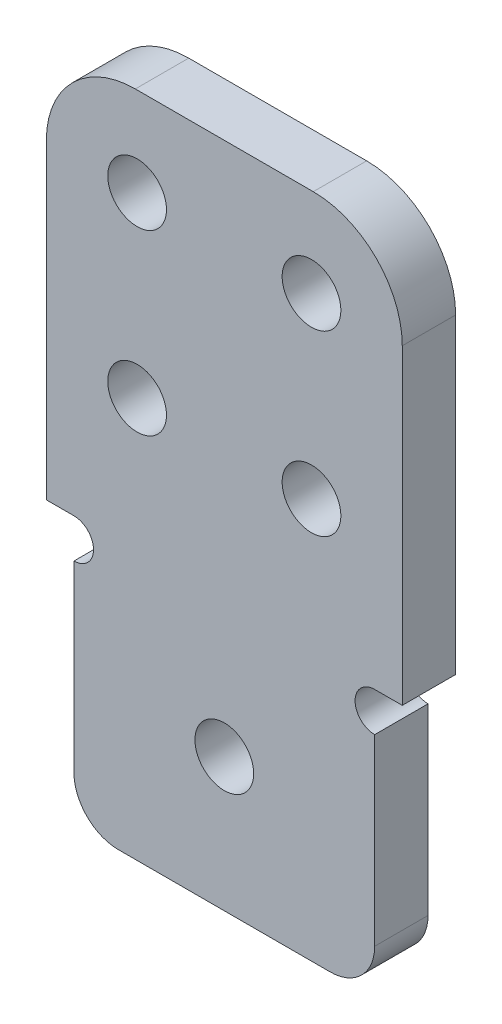
ISO-10303-21;
HEADER;
FILE_DESCRIPTION(('STEP AP214'),'2;1');
FILE_NAME('part.step','',(''),(''),'','','');
FILE_SCHEMA(('AUTOMOTIVE_DESIGN { 1 0 10303 214 1 1 1 1 }'));
ENDSEC;
DATA;
#1=APPLICATION_CONTEXT('core data for automotive mechanical design processes');
#2=APPLICATION_PROTOCOL_DEFINITION('international standard','automotive_design',2000,#1);
#3=PRODUCT_CONTEXT('',#1,'mechanical');
#4=PRODUCT('Part','Part','',(#3));
#5=PRODUCT_RELATED_PRODUCT_CATEGORY('part','',(#4));
#6=PRODUCT_DEFINITION_FORMATION('','',#4);
#7=PRODUCT_DEFINITION_CONTEXT('part definition',#1,'design');
#8=PRODUCT_DEFINITION('design','',#6,#7);
#9=PRODUCT_DEFINITION_SHAPE('','',#8);
#10=(LENGTH_UNIT() NAMED_UNIT(*) SI_UNIT(.MILLI.,.METRE.));
#11=(NAMED_UNIT(*) PLANE_ANGLE_UNIT() SI_UNIT($,.RADIAN.));
#12=(NAMED_UNIT(*) SI_UNIT($,.STERADIAN.) SOLID_ANGLE_UNIT());
#13=UNCERTAINTY_MEASURE_WITH_UNIT(LENGTH_MEASURE(1.E-05),#10,'distance_accuracy_value','');
#14=(GEOMETRIC_REPRESENTATION_CONTEXT(3) GLOBAL_UNCERTAINTY_ASSIGNED_CONTEXT((#13)) GLOBAL_UNIT_ASSIGNED_CONTEXT((#10,
#11,#12)) REPRESENTATION_CONTEXT('',''));
#15=CARTESIAN_POINT('',(0.,0.,0.));
#16=DIRECTION('',(0.,0.,1.));
#17=DIRECTION('',(1.,0.,0.));
#18=AXIS2_PLACEMENT_3D('',#15,#16,#17);
#19=CARTESIAN_POINT('',(-8.45,-13.6,3.));
#20=DIRECTION('',(0.,0.,1.));
#21=DIRECTION('',(1.,0.,0.));
#22=AXIS2_PLACEMENT_3D('',#19,#20,#21);
#23=PLANE('',#22);
#24=CARTESIAN_POINT('',(4.9,5.,3.));
#25=DIRECTION('',(0.,0.,1.));
#26=DIRECTION('',(1.,0.,0.));
#27=AXIS2_PLACEMENT_3D('',#24,#25,#26);
#28=CIRCLE('',#27,1.65);
#29=CARTESIAN_POINT('',(6.55,5.,3.));
#30=VERTEX_POINT('',#29);
#31=EDGE_CURVE('E298',#30,#30,#28,.T.);
#32=ORIENTED_EDGE('',*,*,#31,.F.);
#33=EDGE_LOOP('',(#32));
#34=FACE_BOUND('',#33,.T.);
#35=CARTESIAN_POINT('',(-4.9,-5.,3.));
#36=DIRECTION('',(0.,0.,1.));
#37=DIRECTION('',(1.,0.,0.));
#38=AXIS2_PLACEMENT_3D('',#35,#36,#37);
#39=CIRCLE('',#38,1.65);
#40=CARTESIAN_POINT('',(-3.25,-5.,3.));
#41=VERTEX_POINT('',#40);
#42=EDGE_CURVE('E286',#41,#41,#39,.T.);
#43=ORIENTED_EDGE('',*,*,#42,.F.);
#44=EDGE_LOOP('',(#43));
#45=FACE_BOUND('',#44,.T.);
#46=DIRECTION('',(-1.,0.,0.));
#47=VECTOR('',#46,1.);
#48=CARTESIAN_POINT('',(-10.,9.99999999999999,3.));
#49=LINE('',#48,#47);
#50=CARTESIAN_POINT('',(5.,10.,3.));
#51=VERTEX_POINT('',#50);
#52=CARTESIAN_POINT('',(-5.,9.99999999999999,3.));
#53=VERTEX_POINT('',#52);
#54=EDGE_CURVE('E153',#51,#53,#49,.T.);
#55=ORIENTED_EDGE('',*,*,#54,.T.);
#56=CARTESIAN_POINT('',(-5.,4.99999999999999,3.));
#57=DIRECTION('',(0.,0.,1.));
#58=DIRECTION('',(1.,0.,0.));
#59=AXIS2_PLACEMENT_3D('',#56,#57,#58);
#60=CIRCLE('',#59,5.);
#61=CARTESIAN_POINT('',(-10.,4.99999999999999,3.));
#62=VERTEX_POINT('',#61);
#63=EDGE_CURVE('E149',#53,#62,#60,.T.);
#64=ORIENTED_EDGE('',*,*,#63,.T.);
#65=DIRECTION('',(0.,-1.,0.));
#66=VECTOR('',#65,1.);
#67=CARTESIAN_POINT('',(-10.,-12.5,3.));
#68=LINE('',#67,#66);
#69=CARTESIAN_POINT('',(-10.,-12.5,3.));
#70=VERTEX_POINT('',#69);
#71=EDGE_CURVE('E141',#62,#70,#68,.T.);
#72=ORIENTED_EDGE('',*,*,#71,.T.);
#73=DIRECTION('',(1.,0.,0.));
#74=VECTOR('',#73,1.);
#75=CARTESIAN_POINT('',(-10.,-12.5,3.));
#76=LINE('',#75,#74);
#77=CARTESIAN_POINT('',(-8.45,-12.5,3.));
#78=VERTEX_POINT('',#77);
#79=EDGE_CURVE('E146',#70,#78,#76,.T.);
#80=ORIENTED_EDGE('',*,*,#79,.T.);
#81=CARTESIAN_POINT('',(-8.45,-13.6,3.));
#82=DIRECTION('',(0.,0.,-1.));
#83=DIRECTION('',(1.,0.,0.));
#84=AXIS2_PLACEMENT_3D('',#81,#82,#83);
#85=CIRCLE('',#84,1.1);
#86=CARTESIAN_POINT('',(-8.45,-14.7,3.));
#87=VERTEX_POINT('',#86);
#88=EDGE_CURVE('E168',#78,#87,#85,.T.);
#89=ORIENTED_EDGE('',*,*,#88,.T.);
#90=DIRECTION('',(0.,-1.,0.));
#91=VECTOR('',#90,1.);
#92=CARTESIAN_POINT('',(-8.45,-14.7,3.));
#93=LINE('',#92,#91);
#94=CARTESIAN_POINT('',(-8.45,-25.,3.));
#95=VERTEX_POINT('',#94);
#96=EDGE_CURVE('E170',#87,#95,#93,.T.);
#97=ORIENTED_EDGE('',*,*,#96,.T.);
#98=CARTESIAN_POINT('',(-5.94999999999999,-25.,3.));
#99=DIRECTION('',(0.,0.,1.));
#100=DIRECTION('',(1.,0.,0.));
#101=AXIS2_PLACEMENT_3D('',#98,#99,#100);
#102=CIRCLE('',#101,2.5);
#103=CARTESIAN_POINT('',(-5.95,-27.5,3.));
#104=VERTEX_POINT('',#103);
#105=EDGE_CURVE('E235',#95,#104,#102,.T.);
#106=ORIENTED_EDGE('',*,*,#105,.T.);
#107=DIRECTION('',(1.,0.,0.));
#108=VECTOR('',#107,1.);
#109=CARTESIAN_POINT('',(-8.45,-27.5,3.));
#110=LINE('',#109,#108);
#111=CARTESIAN_POINT('',(5.95,-27.5,3.));
#112=VERTEX_POINT('',#111);
#113=EDGE_CURVE('E176',#104,#112,#110,.T.);
#114=ORIENTED_EDGE('',*,*,#113,.T.);
#115=CARTESIAN_POINT('',(5.95,-25.,3.));
#116=DIRECTION('',(0.,0.,1.));
#117=DIRECTION('',(1.,0.,0.));
#118=AXIS2_PLACEMENT_3D('',#115,#116,#117);
#119=CIRCLE('',#118,2.5);
#120=CARTESIAN_POINT('',(8.45,-25.,3.));
#121=VERTEX_POINT('',#120);
#122=EDGE_CURVE('E57',#112,#121,#119,.T.);
#123=ORIENTED_EDGE('',*,*,#122,.T.);
#124=DIRECTION('',(0.,1.,0.));
#125=VECTOR('',#124,1.);
#126=CARTESIAN_POINT('',(8.45,-14.7,3.));
#127=LINE('',#126,#125);
#128=CARTESIAN_POINT('',(8.45,-14.7,3.));
#129=VERTEX_POINT('',#128);
#130=EDGE_CURVE('E178',#121,#129,#127,.T.);
#131=ORIENTED_EDGE('',*,*,#130,.T.);
#132=CARTESIAN_POINT('',(8.45,-13.6,3.));
#133=DIRECTION('',(0.,0.,-1.));
#134=DIRECTION('',(1.,0.,0.));
#135=AXIS2_PLACEMENT_3D('',#132,#133,#134);
#136=CIRCLE('',#135,1.1);
#137=CARTESIAN_POINT('',(8.45,-12.5,3.));
#138=VERTEX_POINT('',#137);
#139=EDGE_CURVE('E180',#129,#138,#136,.T.);
#140=ORIENTED_EDGE('',*,*,#139,.T.);
#141=DIRECTION('',(1.,0.,0.));
#142=VECTOR('',#141,1.);
#143=CARTESIAN_POINT('',(10.,-12.5,3.));
#144=LINE('',#143,#142);
#145=CARTESIAN_POINT('',(10.,-12.5,3.));
#146=VERTEX_POINT('',#145);
#147=EDGE_CURVE('E182',#138,#146,#144,.T.);
#148=ORIENTED_EDGE('',*,*,#147,.T.);
#149=DIRECTION('',(0.,1.,0.));
#150=VECTOR('',#149,1.);
#151=CARTESIAN_POINT('',(10.,-12.5,3.));
#152=LINE('',#151,#150);
#153=CARTESIAN_POINT('',(10.,4.99999999999999,3.));
#154=VERTEX_POINT('',#153);
#155=EDGE_CURVE('E208',#146,#154,#152,.T.);
#156=ORIENTED_EDGE('',*,*,#155,.T.);
#157=CARTESIAN_POINT('',(5.,5.,3.));
#158=DIRECTION('',(0.,0.,1.));
#159=DIRECTION('',(1.,0.,0.));
#160=AXIS2_PLACEMENT_3D('',#157,#158,#159);
#161=CIRCLE('',#160,5.);
#162=EDGE_CURVE('E238',#154,#51,#161,.T.);
#163=ORIENTED_EDGE('',*,*,#162,.T.);
#164=EDGE_LOOP('',(#55,#64,#72,#80,#89,#97,#106,#114,#123,#131,#140,#148,#156,#163));
#165=FACE_BOUND('',#164,.T.);
#166=CARTESIAN_POINT('',(-4.9,5.,3.));
#167=DIRECTION('',(0.,0.,1.));
#168=DIRECTION('',(1.,0.,0.));
#169=AXIS2_PLACEMENT_3D('',#166,#167,#168);
#170=CIRCLE('',#169,1.65);
#171=CARTESIAN_POINT('',(-3.25,5.,3.));
#172=VERTEX_POINT('',#171);
#173=EDGE_CURVE('E189',#172,#172,#170,.T.);
#174=ORIENTED_EDGE('',*,*,#173,.F.);
#175=EDGE_LOOP('',(#174));
#176=FACE_BOUND('',#175,.T.);
#177=CARTESIAN_POINT('',(4.9,-5.,3.));
#178=DIRECTION('',(0.,0.,1.));
#179=DIRECTION('',(1.,0.,0.));
#180=AXIS2_PLACEMENT_3D('',#177,#178,#179);
#181=CIRCLE('',#180,1.65);
#182=CARTESIAN_POINT('',(6.55,-5.,3.));
#183=VERTEX_POINT('',#182);
#184=EDGE_CURVE('E292',#183,#183,#181,.T.);
#185=ORIENTED_EDGE('',*,*,#184,.F.);
#186=EDGE_LOOP('',(#185));
#187=FACE_BOUND('',#186,.T.);
#188=CARTESIAN_POINT('',(0.,-20.,3.));
#189=DIRECTION('',(0.,0.,1.));
#190=DIRECTION('',(1.,0.,0.));
#191=AXIS2_PLACEMENT_3D('',#188,#189,#190);
#192=CIRCLE('',#191,1.65);
#193=CARTESIAN_POINT('',(1.65,-20.,3.));
#194=VERTEX_POINT('',#193);
#195=EDGE_CURVE('E304',#194,#194,#192,.T.);
#196=ORIENTED_EDGE('',*,*,#195,.F.);
#197=EDGE_LOOP('',(#196));
#198=FACE_BOUND('',#197,.T.);
#199=ADVANCED_FACE('F42',(#34,#45,#165,#176,#187,#198),#23,.T.);
#200=CARTESIAN_POINT('',(-8.45,-13.6,0.));
#201=DIRECTION('',(0.,0.,1.));
#202=DIRECTION('',(1.,0.,0.));
#203=AXIS2_PLACEMENT_3D('',#200,#201,#202);
#204=PLANE('',#203);
#205=DIRECTION('',(0.,-1.,0.));
#206=VECTOR('',#205,1.);
#207=CARTESIAN_POINT('',(-10.,-12.5,0.));
#208=LINE('',#207,#206);
#209=CARTESIAN_POINT('',(-10.,4.99999999999999,0.));
#210=VERTEX_POINT('',#209);
#211=CARTESIAN_POINT('',(-10.,-12.5,0.));
#212=VERTEX_POINT('',#211);
#213=EDGE_CURVE('E159',#210,#212,#208,.T.);
#214=ORIENTED_EDGE('',*,*,#213,.F.);
#215=CARTESIAN_POINT('',(-5.,4.99999999999999,0.));
#216=DIRECTION('',(0.,0.,1.));
#217=DIRECTION('',(1.,0.,0.));
#218=AXIS2_PLACEMENT_3D('',#215,#216,#217);
#219=CIRCLE('',#218,5.);
#220=CARTESIAN_POINT('',(-5.,9.99999999999999,0.));
#221=VERTEX_POINT('',#220);
#222=EDGE_CURVE('E228',#210,#221,#219,.F.);
#223=ORIENTED_EDGE('',*,*,#222,.T.);
#224=DIRECTION('',(-1.,0.,0.));
#225=VECTOR('',#224,1.);
#226=CARTESIAN_POINT('',(-10.,9.99999999999999,0.));
#227=LINE('',#226,#225);
#228=CARTESIAN_POINT('',(5.,10.,0.));
#229=VERTEX_POINT('',#228);
#230=EDGE_CURVE('E188',#229,#221,#227,.T.);
#231=ORIENTED_EDGE('',*,*,#230,.F.);
#232=CARTESIAN_POINT('',(5.,5.,0.));
#233=DIRECTION('',(0.,0.,1.));
#234=DIRECTION('',(1.,0.,0.));
#235=AXIS2_PLACEMENT_3D('',#232,#233,#234);
#236=CIRCLE('',#235,5.);
#237=CARTESIAN_POINT('',(10.,4.99999999999999,0.));
#238=VERTEX_POINT('',#237);
#239=EDGE_CURVE('E226',#229,#238,#236,.F.);
#240=ORIENTED_EDGE('',*,*,#239,.T.);
#241=DIRECTION('',(0.,1.,0.));
#242=VECTOR('',#241,1.);
#243=CARTESIAN_POINT('',(10.,-12.5,0.));
#244=LINE('',#243,#242);
#245=CARTESIAN_POINT('',(10.,-12.5,0.));
#246=VERTEX_POINT('',#245);
#247=EDGE_CURVE('E185',#246,#238,#244,.T.);
#248=ORIENTED_EDGE('',*,*,#247,.F.);
#249=DIRECTION('',(1.,0.,0.));
#250=VECTOR('',#249,1.);
#251=CARTESIAN_POINT('',(10.,-12.5,0.));
#252=LINE('',#251,#250);
#253=CARTESIAN_POINT('',(8.45,-12.5,0.));
#254=VERTEX_POINT('',#253);
#255=EDGE_CURVE('E206',#254,#246,#252,.T.);
#256=ORIENTED_EDGE('',*,*,#255,.F.);
#257=CARTESIAN_POINT('',(8.45,-13.6,0.));
#258=DIRECTION('',(0.,0.,-1.));
#259=DIRECTION('',(1.,0.,0.));
#260=AXIS2_PLACEMENT_3D('',#257,#258,#259);
#261=CIRCLE('',#260,1.1);
#262=CARTESIAN_POINT('',(8.45,-14.7,0.));
#263=VERTEX_POINT('',#262);
#264=EDGE_CURVE('E204',#263,#254,#261,.T.);
#265=ORIENTED_EDGE('',*,*,#264,.F.);
#266=DIRECTION('',(0.,1.,0.));
#267=VECTOR('',#266,1.);
#268=CARTESIAN_POINT('',(8.45,-14.7,0.));
#269=LINE('',#268,#267);
#270=CARTESIAN_POINT('',(8.45,-25.,0.));
#271=VERTEX_POINT('',#270);
#272=EDGE_CURVE('E202',#271,#263,#269,.T.);
#273=ORIENTED_EDGE('',*,*,#272,.F.);
#274=CARTESIAN_POINT('',(5.95,-25.,0.));
#275=DIRECTION('',(0.,0.,1.));
#276=DIRECTION('',(1.,0.,0.));
#277=AXIS2_PLACEMENT_3D('',#274,#275,#276);
#278=CIRCLE('',#277,2.5);
#279=CARTESIAN_POINT('',(5.95,-27.5,0.));
#280=VERTEX_POINT('',#279);
#281=EDGE_CURVE('E224',#271,#280,#278,.F.);
#282=ORIENTED_EDGE('',*,*,#281,.T.);
#283=DIRECTION('',(1.,0.,0.));
#284=VECTOR('',#283,1.);
#285=CARTESIAN_POINT('',(-8.45,-27.5,0.));
#286=LINE('',#285,#284);
#287=CARTESIAN_POINT('',(-5.95,-27.5,0.));
#288=VERTEX_POINT('',#287);
#289=EDGE_CURVE('E200',#288,#280,#286,.T.);
#290=ORIENTED_EDGE('',*,*,#289,.F.);
#291=CARTESIAN_POINT('',(-5.94999999999999,-25.,0.));
#292=DIRECTION('',(0.,0.,1.));
#293=DIRECTION('',(1.,0.,0.));
#294=AXIS2_PLACEMENT_3D('',#291,#292,#293);
#295=CIRCLE('',#294,2.5);
#296=CARTESIAN_POINT('',(-8.45,-25.,0.));
#297=VERTEX_POINT('',#296);
#298=EDGE_CURVE('E222',#288,#297,#295,.F.);
#299=ORIENTED_EDGE('',*,*,#298,.T.);
#300=DIRECTION('',(0.,-1.,0.));
#301=VECTOR('',#300,1.);
#302=CARTESIAN_POINT('',(-8.45,-14.7,0.));
#303=LINE('',#302,#301);
#304=CARTESIAN_POINT('',(-8.45,-14.7,0.));
#305=VERTEX_POINT('',#304);
#306=EDGE_CURVE('E197',#305,#297,#303,.T.);
#307=ORIENTED_EDGE('',*,*,#306,.F.);
#308=CARTESIAN_POINT('',(-8.45,-13.6,0.));
#309=DIRECTION('',(0.,0.,-1.));
#310=DIRECTION('',(1.,0.,0.));
#311=AXIS2_PLACEMENT_3D('',#308,#309,#310);
#312=CIRCLE('',#311,1.1);
#313=CARTESIAN_POINT('',(-8.45,-12.5,0.));
#314=VERTEX_POINT('',#313);
#315=EDGE_CURVE('E195',#314,#305,#312,.T.);
#316=ORIENTED_EDGE('',*,*,#315,.F.);
#317=DIRECTION('',(1.,0.,0.));
#318=VECTOR('',#317,1.);
#319=CARTESIAN_POINT('',(-10.,-12.5,0.));
#320=LINE('',#319,#318);
#321=EDGE_CURVE('E193',#212,#314,#320,.T.);
#322=ORIENTED_EDGE('',*,*,#321,.F.);
#323=EDGE_LOOP('',(#214,#223,#231,#240,#248,#256,#265,#273,#282,#290,#299,#307,#316,#322));
#324=FACE_BOUND('',#323,.T.);
#325=CARTESIAN_POINT('',(-4.9,5.,0.));
#326=DIRECTION('',(0.,0.,1.));
#327=DIRECTION('',(1.,0.,0.));
#328=AXIS2_PLACEMENT_3D('',#325,#326,#327);
#329=CIRCLE('',#328,1.65);
#330=CARTESIAN_POINT('',(-3.25,5.,0.));
#331=VERTEX_POINT('',#330);
#332=EDGE_CURVE('E283',#331,#331,#329,.T.);
#333=ORIENTED_EDGE('',*,*,#332,.T.);
#334=EDGE_LOOP('',(#333));
#335=FACE_BOUND('',#334,.T.);
#336=CARTESIAN_POINT('',(-4.9,-5.,0.));
#337=DIRECTION('',(0.,0.,1.));
#338=DIRECTION('',(1.,0.,0.));
#339=AXIS2_PLACEMENT_3D('',#336,#337,#338);
#340=CIRCLE('',#339,1.65);
#341=CARTESIAN_POINT('',(-3.25,-5.,0.));
#342=VERTEX_POINT('',#341);
#343=EDGE_CURVE('E289',#342,#342,#340,.T.);
#344=ORIENTED_EDGE('',*,*,#343,.T.);
#345=EDGE_LOOP('',(#344));
#346=FACE_BOUND('',#345,.T.);
#347=CARTESIAN_POINT('',(4.9,-5.,0.));
#348=DIRECTION('',(0.,0.,1.));
#349=DIRECTION('',(1.,0.,0.));
#350=AXIS2_PLACEMENT_3D('',#347,#348,#349);
#351=CIRCLE('',#350,1.65);
#352=CARTESIAN_POINT('',(6.55,-5.,0.));
#353=VERTEX_POINT('',#352);
#354=EDGE_CURVE('E295',#353,#353,#351,.T.);
#355=ORIENTED_EDGE('',*,*,#354,.T.);
#356=EDGE_LOOP('',(#355));
#357=FACE_BOUND('',#356,.T.);
#358=CARTESIAN_POINT('',(4.9,5.,0.));
#359=DIRECTION('',(0.,0.,1.));
#360=DIRECTION('',(1.,0.,0.));
#361=AXIS2_PLACEMENT_3D('',#358,#359,#360);
#362=CIRCLE('',#361,1.65);
#363=CARTESIAN_POINT('',(6.55,5.,0.));
#364=VERTEX_POINT('',#363);
#365=EDGE_CURVE('E301',#364,#364,#362,.T.);
#366=ORIENTED_EDGE('',*,*,#365,.T.);
#367=EDGE_LOOP('',(#366));
#368=FACE_BOUND('',#367,.T.);
#369=CARTESIAN_POINT('',(0.,-20.,0.));
#370=DIRECTION('',(0.,0.,1.));
#371=DIRECTION('',(1.,0.,0.));
#372=AXIS2_PLACEMENT_3D('',#369,#370,#371);
#373=CIRCLE('',#372,1.65);
#374=CARTESIAN_POINT('',(1.65,-20.,0.));
#375=VERTEX_POINT('',#374);
#376=EDGE_CURVE('E307',#375,#375,#373,.T.);
#377=ORIENTED_EDGE('',*,*,#376,.T.);
#378=EDGE_LOOP('',(#377));
#379=FACE_BOUND('',#378,.T.);
#380=ADVANCED_FACE('F254',(#324,#335,#346,#357,#368,#379),#204,.F.);
#381=CARTESIAN_POINT('',(10.,-12.5,3.));
#382=DIRECTION('',(-1.,0.,0.));
#383=DIRECTION('',(0.,-1.,0.));
#384=AXIS2_PLACEMENT_3D('',#381,#382,#383);
#385=PLANE('',#384);
#386=ORIENTED_EDGE('',*,*,#247,.T.);
#387=DIRECTION('',(0.,0.,-1.));
#388=VECTOR('',#387,1.);
#389=CARTESIAN_POINT('',(10.,5.,3.));
#390=LINE('',#389,#388);
#391=EDGE_CURVE('E241',#238,#154,#390,.F.);
#392=ORIENTED_EDGE('',*,*,#391,.T.);
#393=ORIENTED_EDGE('',*,*,#155,.F.);
#394=DIRECTION('',(0.,0.,-1.));
#395=VECTOR('',#394,1.);
#396=CARTESIAN_POINT('',(10.,-12.5,3.));
#397=LINE('',#396,#395);
#398=EDGE_CURVE('E184',#146,#246,#397,.T.);
#399=ORIENTED_EDGE('',*,*,#398,.T.);
#400=EDGE_LOOP('',(#386,#392,#393,#399));
#401=FACE_BOUND('',#400,.T.);
#402=ADVANCED_FACE('F278',(#401),#385,.F.);
#403=CARTESIAN_POINT('',(-10.,9.99999999999999,3.));
#404=DIRECTION('',(0.,-1.,0.));
#405=DIRECTION('',(1.,0.,0.));
#406=AXIS2_PLACEMENT_3D('',#403,#404,#405);
#407=PLANE('',#406);
#408=ORIENTED_EDGE('',*,*,#230,.T.);
#409=DIRECTION('',(0.,0.,-1.));
#410=VECTOR('',#409,1.);
#411=CARTESIAN_POINT('',(-5.,9.99999999999999,3.));
#412=LINE('',#411,#410);
#413=EDGE_CURVE('E233',#221,#53,#412,.F.);
#414=ORIENTED_EDGE('',*,*,#413,.T.);
#415=ORIENTED_EDGE('',*,*,#54,.F.);
#416=DIRECTION('',(0.,0.,-1.));
#417=VECTOR('',#416,1.);
#418=CARTESIAN_POINT('',(5.,10.,3.));
#419=LINE('',#418,#417);
#420=EDGE_CURVE('E230',#51,#229,#419,.T.);
#421=ORIENTED_EDGE('',*,*,#420,.T.);
#422=EDGE_LOOP('',(#408,#414,#415,#421));
#423=FACE_BOUND('',#422,.T.);
#424=ADVANCED_FACE('F350',(#423),#407,.F.);
#425=CARTESIAN_POINT('',(-10.,-12.5,3.));
#426=DIRECTION('',(1.,0.,0.));
#427=DIRECTION('',(0.,0.,-1.));
#428=AXIS2_PLACEMENT_3D('',#425,#426,#427);
#429=PLANE('',#428);
#430=ORIENTED_EDGE('',*,*,#71,.F.);
#431=DIRECTION('',(0.,0.,-1.));
#432=VECTOR('',#431,1.);
#433=CARTESIAN_POINT('',(-10.,4.99999999999999,3.));
#434=LINE('',#433,#432);
#435=EDGE_CURVE('E162',#62,#210,#434,.T.);
#436=ORIENTED_EDGE('',*,*,#435,.T.);
#437=ORIENTED_EDGE('',*,*,#213,.T.);
#438=DIRECTION('',(0.,0.,-1.));
#439=VECTOR('',#438,1.);
#440=CARTESIAN_POINT('',(-10.,-12.5,3.));
#441=LINE('',#440,#439);
#442=EDGE_CURVE('E156',#70,#212,#441,.T.);
#443=ORIENTED_EDGE('',*,*,#442,.F.);
#444=EDGE_LOOP('',(#430,#436,#437,#443));
#445=FACE_BOUND('',#444,.T.);
#446=ADVANCED_FACE('F157',(#445),#429,.F.);
#447=CARTESIAN_POINT('',(-10.,-12.5,3.));
#448=DIRECTION('',(0.,1.,0.));
#449=DIRECTION('',(0.,0.,1.));
#450=AXIS2_PLACEMENT_3D('',#447,#448,#449);
#451=PLANE('',#450);
#452=ORIENTED_EDGE('',*,*,#321,.T.);
#453=DIRECTION('',(0.,0.,-1.));
#454=VECTOR('',#453,1.);
#455=CARTESIAN_POINT('',(-8.45,-12.5,3.));
#456=LINE('',#455,#454);
#457=EDGE_CURVE('E163',#78,#314,#456,.T.);
#458=ORIENTED_EDGE('',*,*,#457,.F.);
#459=ORIENTED_EDGE('',*,*,#79,.F.);
#460=ORIENTED_EDGE('',*,*,#442,.T.);
#461=EDGE_LOOP('',(#452,#458,#459,#460));
#462=FACE_BOUND('',#461,.T.);
#463=ADVANCED_FACE('F165',(#462),#451,.F.);
#464=CARTESIAN_POINT('',(-8.45,-13.6,3.));
#465=DIRECTION('',(0.,0.,-1.));
#466=DIRECTION('',(-1.,0.,0.));
#467=AXIS2_PLACEMENT_3D('',#464,#465,#466);
#468=CYLINDRICAL_SURFACE('',#467,1.1);
#469=ORIENTED_EDGE('',*,*,#315,.T.);
#470=DIRECTION('',(0.,0.,-1.));
#471=VECTOR('',#470,1.);
#472=CARTESIAN_POINT('',(-8.45,-14.7,3.));
#473=LINE('',#472,#471);
#474=EDGE_CURVE('E217',#87,#305,#473,.T.);
#475=ORIENTED_EDGE('',*,*,#474,.F.);
#476=ORIENTED_EDGE('',*,*,#88,.F.);
#477=ORIENTED_EDGE('',*,*,#457,.T.);
#478=EDGE_LOOP('',(#469,#475,#476,#477));
#479=FACE_BOUND('',#478,.T.);
#480=ADVANCED_FACE('F341',(#479),#468,.F.);
#481=CARTESIAN_POINT('',(-8.45,-14.7,3.));
#482=DIRECTION('',(1.,0.,0.));
#483=DIRECTION('',(0.,1.,0.));
#484=AXIS2_PLACEMENT_3D('',#481,#482,#483);
#485=PLANE('',#484);
#486=ORIENTED_EDGE('',*,*,#306,.T.);
#487=DIRECTION('',(0.,0.,-1.));
#488=VECTOR('',#487,1.);
#489=CARTESIAN_POINT('',(-8.45,-25.,3.));
#490=LINE('',#489,#488);
#491=EDGE_CURVE('E12',#297,#95,#490,.F.);
#492=ORIENTED_EDGE('',*,*,#491,.T.);
#493=ORIENTED_EDGE('',*,*,#96,.F.);
#494=ORIENTED_EDGE('',*,*,#474,.T.);
#495=EDGE_LOOP('',(#486,#492,#493,#494));
#496=FACE_BOUND('',#495,.T.);
#497=ADVANCED_FACE('F338',(#496),#485,.F.);
#498=CARTESIAN_POINT('',(-8.45,-27.5,3.));
#499=DIRECTION('',(0.,1.,0.));
#500=DIRECTION('',(0.,0.,1.));
#501=AXIS2_PLACEMENT_3D('',#498,#499,#500);
#502=PLANE('',#501);
#503=ORIENTED_EDGE('',*,*,#289,.T.);
#504=DIRECTION('',(0.,0.,-1.));
#505=VECTOR('',#504,1.);
#506=CARTESIAN_POINT('',(5.95,-27.5,3.));
#507=LINE('',#506,#505);
#508=EDGE_CURVE('E50',#280,#112,#507,.F.);
#509=ORIENTED_EDGE('',*,*,#508,.T.);
#510=ORIENTED_EDGE('',*,*,#113,.F.);
#511=DIRECTION('',(0.,0.,-1.));
#512=VECTOR('',#511,1.);
#513=CARTESIAN_POINT('',(-5.94999999999999,-27.5,3.));
#514=LINE('',#513,#512);
#515=EDGE_CURVE('E246',#104,#288,#514,.T.);
#516=ORIENTED_EDGE('',*,*,#515,.T.);
#517=EDGE_LOOP('',(#503,#509,#510,#516));
#518=FACE_BOUND('',#517,.T.);
#519=ADVANCED_FACE('F250',(#518),#502,.F.);
#520=CARTESIAN_POINT('',(8.45,-14.7,3.));
#521=DIRECTION('',(-1.,0.,0.));
#522=DIRECTION('',(0.,-1.,0.));
#523=AXIS2_PLACEMENT_3D('',#520,#521,#522);
#524=PLANE('',#523);
#525=ORIENTED_EDGE('',*,*,#130,.F.);
#526=DIRECTION('',(0.,0.,-1.));
#527=VECTOR('',#526,1.);
#528=CARTESIAN_POINT('',(8.45,-25.,3.));
#529=LINE('',#528,#527);
#530=EDGE_CURVE('E243',#121,#271,#529,.T.);
#531=ORIENTED_EDGE('',*,*,#530,.T.);
#532=ORIENTED_EDGE('',*,*,#272,.T.);
#533=DIRECTION('',(0.,0.,-1.));
#534=VECTOR('',#533,1.);
#535=CARTESIAN_POINT('',(8.45,-14.7,3.));
#536=LINE('',#535,#534);
#537=EDGE_CURVE('E214',#129,#263,#536,.T.);
#538=ORIENTED_EDGE('',*,*,#537,.F.);
#539=EDGE_LOOP('',(#525,#531,#532,#538));
#540=FACE_BOUND('',#539,.T.);
#541=ADVANCED_FACE('F263',(#540),#524,.F.);
#542=CARTESIAN_POINT('',(8.45,-13.6,3.));
#543=DIRECTION('',(0.,0.,-1.));
#544=DIRECTION('',(-1.,0.,0.));
#545=AXIS2_PLACEMENT_3D('',#542,#543,#544);
#546=CYLINDRICAL_SURFACE('',#545,1.1);
#547=ORIENTED_EDGE('',*,*,#264,.T.);
#548=DIRECTION('',(0.,0.,-1.));
#549=VECTOR('',#548,1.);
#550=CARTESIAN_POINT('',(8.45,-12.5,3.));
#551=LINE('',#550,#549);
#552=EDGE_CURVE('E211',#138,#254,#551,.T.);
#553=ORIENTED_EDGE('',*,*,#552,.F.);
#554=ORIENTED_EDGE('',*,*,#139,.F.);
#555=ORIENTED_EDGE('',*,*,#537,.T.);
#556=EDGE_LOOP('',(#547,#553,#554,#555));
#557=FACE_BOUND('',#556,.T.);
#558=ADVANCED_FACE('F271',(#557),#546,.F.);
#559=CARTESIAN_POINT('',(10.,-12.5,3.));
#560=DIRECTION('',(0.,1.,0.));
#561=DIRECTION('',(-1.,0.,0.));
#562=AXIS2_PLACEMENT_3D('',#559,#560,#561);
#563=PLANE('',#562);
#564=ORIENTED_EDGE('',*,*,#255,.T.);
#565=ORIENTED_EDGE('',*,*,#398,.F.);
#566=ORIENTED_EDGE('',*,*,#147,.F.);
#567=ORIENTED_EDGE('',*,*,#552,.T.);
#568=EDGE_LOOP('',(#564,#565,#566,#567));
#569=FACE_BOUND('',#568,.T.);
#570=ADVANCED_FACE('F274',(#569),#563,.F.);
#571=CARTESIAN_POINT('',(-4.9,5.,3.));
#572=DIRECTION('',(0.,0.,-1.));
#573=DIRECTION('',(-1.,0.,0.));
#574=AXIS2_PLACEMENT_3D('',#571,#572,#573);
#575=CYLINDRICAL_SURFACE('',#574,1.65);
#576=ORIENTED_EDGE('',*,*,#173,.T.);
#577=EDGE_LOOP('',(#576));
#578=FACE_BOUND('',#577,.T.);
#579=ORIENTED_EDGE('',*,*,#332,.F.);
#580=EDGE_LOOP('',(#579));
#581=FACE_BOUND('',#580,.T.);
#582=ADVANCED_FACE('F327',(#578,#581),#575,.F.);
#583=CARTESIAN_POINT('',(-4.9,-5.,3.));
#584=DIRECTION('',(0.,0.,-1.));
#585=DIRECTION('',(-1.,0.,0.));
#586=AXIS2_PLACEMENT_3D('',#583,#584,#585);
#587=CYLINDRICAL_SURFACE('',#586,1.65);
#588=ORIENTED_EDGE('',*,*,#42,.T.);
#589=EDGE_LOOP('',(#588));
#590=FACE_BOUND('',#589,.T.);
#591=ORIENTED_EDGE('',*,*,#343,.F.);
#592=EDGE_LOOP('',(#591));
#593=FACE_BOUND('',#592,.T.);
#594=ADVANCED_FACE('F421',(#590,#593),#587,.F.);
#595=CARTESIAN_POINT('',(4.9,-5.,3.));
#596=DIRECTION('',(0.,0.,-1.));
#597=DIRECTION('',(-1.,0.,0.));
#598=AXIS2_PLACEMENT_3D('',#595,#596,#597);
#599=CYLINDRICAL_SURFACE('',#598,1.65);
#600=ORIENTED_EDGE('',*,*,#184,.T.);
#601=EDGE_LOOP('',(#600));
#602=FACE_BOUND('',#601,.T.);
#603=ORIENTED_EDGE('',*,*,#354,.F.);
#604=EDGE_LOOP('',(#603));
#605=FACE_BOUND('',#604,.T.);
#606=ADVANCED_FACE('F411',(#602,#605),#599,.F.);
#607=CARTESIAN_POINT('',(4.9,5.,3.));
#608=DIRECTION('',(0.,0.,-1.));
#609=DIRECTION('',(-1.,0.,0.));
#610=AXIS2_PLACEMENT_3D('',#607,#608,#609);
#611=CYLINDRICAL_SURFACE('',#610,1.65);
#612=ORIENTED_EDGE('',*,*,#31,.T.);
#613=EDGE_LOOP('',(#612));
#614=FACE_BOUND('',#613,.T.);
#615=ORIENTED_EDGE('',*,*,#365,.F.);
#616=EDGE_LOOP('',(#615));
#617=FACE_BOUND('',#616,.T.);
#618=ADVANCED_FACE('F402',(#614,#617),#611,.F.);
#619=CARTESIAN_POINT('',(0.,-20.,3.));
#620=DIRECTION('',(0.,0.,-1.));
#621=DIRECTION('',(-1.,0.,0.));
#622=AXIS2_PLACEMENT_3D('',#619,#620,#621);
#623=CYLINDRICAL_SURFACE('',#622,1.65);
#624=ORIENTED_EDGE('',*,*,#195,.T.);
#625=EDGE_LOOP('',(#624));
#626=FACE_BOUND('',#625,.T.);
#627=ORIENTED_EDGE('',*,*,#376,.F.);
#628=EDGE_LOOP('',(#627));
#629=FACE_BOUND('',#628,.T.);
#630=ADVANCED_FACE('F313',(#626,#629),#623,.F.);
#631=CARTESIAN_POINT('',(-5.,4.99999999999999,3.));
#632=DIRECTION('',(0.,0.,-1.));
#633=DIRECTION('',(-1.,0.,0.));
#634=AXIS2_PLACEMENT_3D('',#631,#632,#633);
#635=CYLINDRICAL_SURFACE('',#634,5.);
#636=ORIENTED_EDGE('',*,*,#63,.F.);
#637=ORIENTED_EDGE('',*,*,#413,.F.);
#638=ORIENTED_EDGE('',*,*,#222,.F.);
#639=ORIENTED_EDGE('',*,*,#435,.F.);
#640=EDGE_LOOP('',(#636,#637,#638,#639));
#641=FACE_BOUND('',#640,.T.);
#642=ADVANCED_FACE('F356',(#641),#635,.T.);
#643=CARTESIAN_POINT('',(5.,5.,3.));
#644=DIRECTION('',(0.,0.,-1.));
#645=DIRECTION('',(-1.,0.,0.));
#646=AXIS2_PLACEMENT_3D('',#643,#644,#645);
#647=CYLINDRICAL_SURFACE('',#646,5.);
#648=ORIENTED_EDGE('',*,*,#162,.F.);
#649=ORIENTED_EDGE('',*,*,#391,.F.);
#650=ORIENTED_EDGE('',*,*,#239,.F.);
#651=ORIENTED_EDGE('',*,*,#420,.F.);
#652=EDGE_LOOP('',(#648,#649,#650,#651));
#653=FACE_BOUND('',#652,.T.);
#654=ADVANCED_FACE('F359',(#653),#647,.T.);
#655=CARTESIAN_POINT('',(5.95,-25.,3.));
#656=DIRECTION('',(0.,0.,-1.));
#657=DIRECTION('',(-1.,0.,0.));
#658=AXIS2_PLACEMENT_3D('',#655,#656,#657);
#659=CYLINDRICAL_SURFACE('',#658,2.5);
#660=ORIENTED_EDGE('',*,*,#122,.F.);
#661=ORIENTED_EDGE('',*,*,#508,.F.);
#662=ORIENTED_EDGE('',*,*,#281,.F.);
#663=ORIENTED_EDGE('',*,*,#530,.F.);
#664=EDGE_LOOP('',(#660,#661,#662,#663));
#665=FACE_BOUND('',#664,.T.);
#666=ADVANCED_FACE('F261',(#665),#659,.T.);
#667=CARTESIAN_POINT('',(-5.94999999999999,-25.,3.));
#668=DIRECTION('',(0.,0.,-1.));
#669=DIRECTION('',(-1.,0.,0.));
#670=AXIS2_PLACEMENT_3D('',#667,#668,#669);
#671=CYLINDRICAL_SURFACE('',#670,2.5);
#672=ORIENTED_EDGE('',*,*,#105,.F.);
#673=ORIENTED_EDGE('',*,*,#491,.F.);
#674=ORIENTED_EDGE('',*,*,#298,.F.);
#675=ORIENTED_EDGE('',*,*,#515,.F.);
#676=EDGE_LOOP('',(#672,#673,#674,#675));
#677=FACE_BOUND('',#676,.T.);
#678=ADVANCED_FACE('F44',(#677),#671,.T.);
#679=CLOSED_SHELL('',(#199,#380,#402,#424,#446,#463,#480,#497,#519,#541,#558,#570,#582,#594,
#606,#618,#630,#642,#654,#666,#678));
#680=MANIFOLD_SOLID_BREP('B2',#679);
#681=ADVANCED_BREP_SHAPE_REPRESENTATION('',(#18,#680),#14);
#682=SHAPE_DEFINITION_REPRESENTATION(#9,#681);
ENDSEC;
END-ISO-10303-21;
